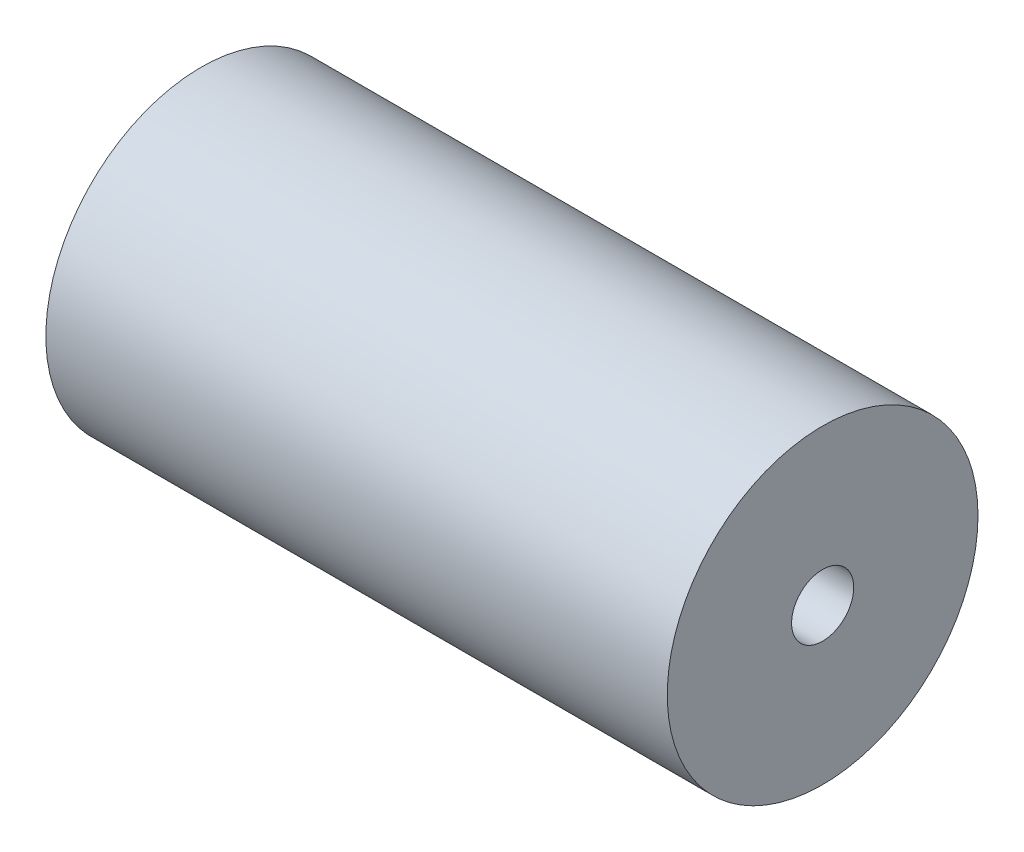
ISO-10303-21;
HEADER;
FILE_DESCRIPTION(('STEP AP214'),'2;1');
FILE_NAME('part.step','',(''),(''),'','','');
FILE_SCHEMA(('AUTOMOTIVE_DESIGN { 1 0 10303 214 1 1 1 1 }'));
ENDSEC;
DATA;
#1=APPLICATION_CONTEXT('core data for automotive mechanical design processes');
#2=APPLICATION_PROTOCOL_DEFINITION('international standard','automotive_design',2000,#1);
#3=PRODUCT_CONTEXT('',#1,'mechanical');
#4=PRODUCT('Part','Part','',(#3));
#5=PRODUCT_RELATED_PRODUCT_CATEGORY('part','',(#4));
#6=PRODUCT_DEFINITION_FORMATION('','',#4);
#7=PRODUCT_DEFINITION_CONTEXT('part definition',#1,'design');
#8=PRODUCT_DEFINITION('design','',#6,#7);
#9=PRODUCT_DEFINITION_SHAPE('','',#8);
#10=(LENGTH_UNIT() NAMED_UNIT(*) SI_UNIT(.MILLI.,.METRE.));
#11=(NAMED_UNIT(*) PLANE_ANGLE_UNIT() SI_UNIT($,.RADIAN.));
#12=(NAMED_UNIT(*) SI_UNIT($,.STERADIAN.) SOLID_ANGLE_UNIT());
#13=UNCERTAINTY_MEASURE_WITH_UNIT(LENGTH_MEASURE(1.E-05),#10,'distance_accuracy_value','');
#14=(GEOMETRIC_REPRESENTATION_CONTEXT(3) GLOBAL_UNCERTAINTY_ASSIGNED_CONTEXT((#13)) GLOBAL_UNIT_ASSIGNED_CONTEXT((#10,
#11,#12)) REPRESENTATION_CONTEXT('',''));
#15=CARTESIAN_POINT('',(0.,0.,0.));
#16=DIRECTION('',(0.,0.,1.));
#17=DIRECTION('',(1.,0.,0.));
#18=AXIS2_PLACEMENT_3D('',#15,#16,#17);
#19=CARTESIAN_POINT('',(10.,0.,0.));
#20=DIRECTION('',(1.,0.,0.));
#21=DIRECTION('',(0.,0.,-1.));
#22=AXIS2_PLACEMENT_3D('',#19,#20,#21);
#23=PLANE('',#22);
#24=CARTESIAN_POINT('',(10.,0.,0.));
#25=DIRECTION('',(1.,0.,0.));
#26=DIRECTION('',(0.,0.,-1.));
#27=AXIS2_PLACEMENT_3D('',#24,#25,#26);
#28=CIRCLE('',#27,2.5);
#29=CARTESIAN_POINT('',(10.,0.,-2.5));
#30=VERTEX_POINT('',#29);
#31=EDGE_CURVE('E10',#30,#30,#28,.T.);
#32=ORIENTED_EDGE('',*,*,#31,.T.);
#33=EDGE_LOOP('',(#32));
#34=FACE_BOUND('',#33,.T.);
#35=CARTESIAN_POINT('',(10.,0.,0.));
#36=DIRECTION('',(1.,0.,0.));
#37=DIRECTION('',(0.,0.,-1.));
#38=AXIS2_PLACEMENT_3D('',#35,#36,#37);
#39=CIRCLE('',#38,0.5);
#40=CARTESIAN_POINT('',(10.,0.,-0.5));
#41=VERTEX_POINT('',#40);
#42=EDGE_CURVE('E41',#41,#41,#39,.T.);
#43=ORIENTED_EDGE('',*,*,#42,.F.);
#44=EDGE_LOOP('',(#43));
#45=FACE_BOUND('',#44,.T.);
#46=ADVANCED_FACE('F30',(#34,#45),#23,.T.);
#47=CARTESIAN_POINT('',(0.,0.,0.));
#48=DIRECTION('',(1.,0.,0.));
#49=DIRECTION('',(0.,0.,-1.));
#50=AXIS2_PLACEMENT_3D('',#47,#48,#49);
#51=PLANE('',#50);
#52=CARTESIAN_POINT('',(0.,0.,0.));
#53=DIRECTION('',(1.,0.,0.));
#54=DIRECTION('',(0.,0.,-1.));
#55=AXIS2_PLACEMENT_3D('',#52,#53,#54);
#56=CIRCLE('',#55,2.5);
#57=CARTESIAN_POINT('',(0.,0.,-2.5));
#58=VERTEX_POINT('',#57);
#59=EDGE_CURVE('E34',#58,#58,#56,.T.);
#60=ORIENTED_EDGE('',*,*,#59,.F.);
#61=EDGE_LOOP('',(#60));
#62=FACE_BOUND('',#61,.T.);
#63=CARTESIAN_POINT('',(0.,0.,0.));
#64=DIRECTION('',(1.,0.,0.));
#65=DIRECTION('',(0.,0.,-1.));
#66=AXIS2_PLACEMENT_3D('',#63,#64,#65);
#67=CIRCLE('',#66,0.5);
#68=CARTESIAN_POINT('',(0.,0.,-0.5));
#69=VERTEX_POINT('',#68);
#70=EDGE_CURVE('E43',#69,#69,#67,.T.);
#71=ORIENTED_EDGE('',*,*,#70,.T.);
#72=EDGE_LOOP('',(#71));
#73=FACE_BOUND('',#72,.T.);
#74=ADVANCED_FACE('F53',(#62,#73),#51,.F.);
#75=CARTESIAN_POINT('',(10.,0.,0.));
#76=DIRECTION('',(-1.,0.,0.));
#77=DIRECTION('',(0.,0.,1.));
#78=AXIS2_PLACEMENT_3D('',#75,#76,#77);
#79=CYLINDRICAL_SURFACE('',#78,2.5);
#80=ORIENTED_EDGE('',*,*,#31,.F.);
#81=EDGE_LOOP('',(#80));
#82=FACE_BOUND('',#81,.T.);
#83=ORIENTED_EDGE('',*,*,#59,.T.);
#84=EDGE_LOOP('',(#83));
#85=FACE_BOUND('',#84,.T.);
#86=ADVANCED_FACE('F32',(#82,#85),#79,.T.);
#87=CARTESIAN_POINT('',(10.,0.,0.));
#88=DIRECTION('',(-1.,0.,0.));
#89=DIRECTION('',(0.,0.,1.));
#90=AXIS2_PLACEMENT_3D('',#87,#88,#89);
#91=CYLINDRICAL_SURFACE('',#90,0.5);
#92=ORIENTED_EDGE('',*,*,#42,.T.);
#93=EDGE_LOOP('',(#92));
#94=FACE_BOUND('',#93,.T.);
#95=ORIENTED_EDGE('',*,*,#70,.F.);
#96=EDGE_LOOP('',(#95));
#97=FACE_BOUND('',#96,.T.);
#98=ADVANCED_FACE('F49',(#94,#97),#91,.F.);
#99=CLOSED_SHELL('',(#46,#74,#86,#98));
#100=MANIFOLD_SOLID_BREP('B2',#99);
#101=ADVANCED_BREP_SHAPE_REPRESENTATION('',(#18,#100),#14);
#102=SHAPE_DEFINITION_REPRESENTATION(#9,#101);
ENDSEC;
END-ISO-10303-21;
